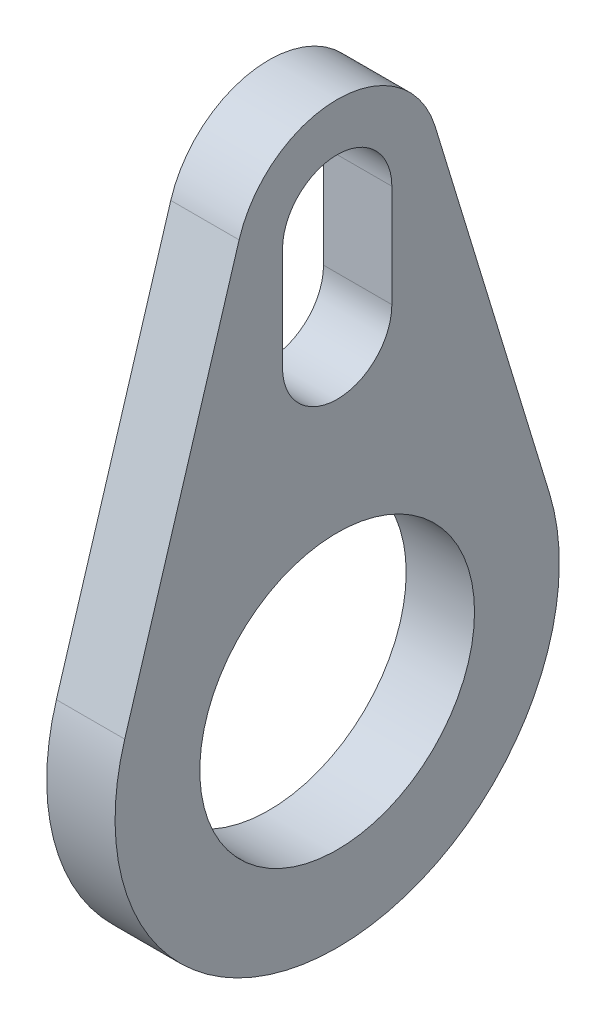
ISO-10303-21;
HEADER;
FILE_DESCRIPTION(('STEP AP214'),'2;1');
FILE_NAME('part.step','',(''),(''),'','','');
FILE_SCHEMA(('AUTOMOTIVE_DESIGN { 1 0 10303 214 1 1 1 1 }'));
ENDSEC;
DATA;
#1=APPLICATION_CONTEXT('core data for automotive mechanical design processes');
#2=APPLICATION_PROTOCOL_DEFINITION('international standard','automotive_design',2000,#1);
#3=PRODUCT_CONTEXT('',#1,'mechanical');
#4=PRODUCT('Part','Part','',(#3));
#5=PRODUCT_RELATED_PRODUCT_CATEGORY('part','',(#4));
#6=PRODUCT_DEFINITION_FORMATION('','',#4);
#7=PRODUCT_DEFINITION_CONTEXT('part definition',#1,'design');
#8=PRODUCT_DEFINITION('design','',#6,#7);
#9=PRODUCT_DEFINITION_SHAPE('','',#8);
#10=(LENGTH_UNIT() NAMED_UNIT(*) SI_UNIT(.MILLI.,.METRE.));
#11=(NAMED_UNIT(*) PLANE_ANGLE_UNIT() SI_UNIT($,.RADIAN.));
#12=(NAMED_UNIT(*) SI_UNIT($,.STERADIAN.) SOLID_ANGLE_UNIT());
#13=UNCERTAINTY_MEASURE_WITH_UNIT(LENGTH_MEASURE(1.E-05),#10,'distance_accuracy_value','');
#14=(GEOMETRIC_REPRESENTATION_CONTEXT(3) GLOBAL_UNCERTAINTY_ASSIGNED_CONTEXT((#13)) GLOBAL_UNIT_ASSIGNED_CONTEXT((#10,
#11,#12)) REPRESENTATION_CONTEXT('',''));
#15=CARTESIAN_POINT('',(0.,0.,0.));
#16=DIRECTION('',(0.,0.,1.));
#17=DIRECTION('',(1.,0.,0.));
#18=AXIS2_PLACEMENT_3D('',#15,#16,#17);
#19=CARTESIAN_POINT('',(85.,4.73958333333333,15.5434503835663));
#20=DIRECTION('',(0.,0.291666666666667,0.956520023604083));
#21=DIRECTION('',(0.,-0.956520023604083,0.291666666666667));
#22=AXIS2_PLACEMENT_3D('',#19,#20,#21);
#23=PLANE('',#22);
#24=DIRECTION('',(0.,-0.956520023604083,0.291666666666667));
#25=VECTOR('',#24,1.);
#26=CARTESIAN_POINT('',(90.,4.73958333333333,15.5434503835663));
#27=LINE('',#26,#25);
#28=CARTESIAN_POINT('',(90.,32.1875,7.17390017703062));
#29=VERTEX_POINT('',#28);
#30=CARTESIAN_POINT('',(90.,4.73958333333333,15.5434503835663));
#31=VERTEX_POINT('',#30);
#32=EDGE_CURVE('E147',#29,#31,#27,.T.);
#33=ORIENTED_EDGE('',*,*,#32,.F.);
#34=DIRECTION('',(1.,0.,0.));
#35=VECTOR('',#34,1.);
#36=CARTESIAN_POINT('',(85.,32.1875,7.17390017703062));
#37=LINE('',#36,#35);
#38=CARTESIAN_POINT('',(85.,32.1875,7.17390017703062));
#39=VERTEX_POINT('',#38);
#40=EDGE_CURVE('E11',#39,#29,#37,.T.);
#41=ORIENTED_EDGE('',*,*,#40,.F.);
#42=DIRECTION('',(0.,-0.956520023604083,0.291666666666667));
#43=VECTOR('',#42,1.);
#44=CARTESIAN_POINT('',(85.,4.73958333333333,15.5434503835663));
#45=LINE('',#44,#43);
#46=CARTESIAN_POINT('',(85.,4.73958333333333,15.5434503835663));
#47=VERTEX_POINT('',#46);
#48=EDGE_CURVE('E127',#39,#47,#45,.T.);
#49=ORIENTED_EDGE('',*,*,#48,.T.);
#50=DIRECTION('',(1.,0.,0.));
#51=VECTOR('',#50,1.);
#52=CARTESIAN_POINT('',(85.,4.73958333333333,15.5434503835663));
#53=LINE('',#52,#51);
#54=EDGE_CURVE('E124',#47,#31,#53,.T.);
#55=ORIENTED_EDGE('',*,*,#54,.T.);
#56=EDGE_LOOP('',(#33,#41,#49,#55));
#57=FACE_BOUND('',#56,.T.);
#58=ADVANCED_FACE('F36',(#57),#23,.T.);
#59=CARTESIAN_POINT('',(85.,30.,0.));
#60=DIRECTION('',(1.,0.,0.));
#61=DIRECTION('',(0.,0.,-1.));
#62=AXIS2_PLACEMENT_3D('',#59,#60,#61);
#63=CYLINDRICAL_SURFACE('',#62,7.5);
#64=CARTESIAN_POINT('',(90.,30.,0.));
#65=DIRECTION('',(1.,0.,0.));
#66=DIRECTION('',(0.,0.,-1.));
#67=AXIS2_PLACEMENT_3D('',#64,#65,#66);
#68=CIRCLE('',#67,7.5);
#69=CARTESIAN_POINT('',(90.,32.1875,-7.17390017703062));
#70=VERTEX_POINT('',#69);
#71=EDGE_CURVE('E153',#29,#70,#68,.F.);
#72=ORIENTED_EDGE('',*,*,#71,.T.);
#73=DIRECTION('',(1.,0.,0.));
#74=VECTOR('',#73,1.);
#75=CARTESIAN_POINT('',(85.,32.1875,-7.17390017703062));
#76=LINE('',#75,#74);
#77=CARTESIAN_POINT('',(85.,32.1875,-7.17390017703062));
#78=VERTEX_POINT('',#77);
#79=EDGE_CURVE('E46',#78,#70,#76,.T.);
#80=ORIENTED_EDGE('',*,*,#79,.F.);
#81=CARTESIAN_POINT('',(85.,30.,0.));
#82=DIRECTION('',(1.,0.,0.));
#83=DIRECTION('',(0.,0.,-1.));
#84=AXIS2_PLACEMENT_3D('',#81,#82,#83);
#85=CIRCLE('',#84,7.5);
#86=EDGE_CURVE('E116',#39,#78,#85,.F.);
#87=ORIENTED_EDGE('',*,*,#86,.F.);
#88=ORIENTED_EDGE('',*,*,#40,.T.);
#89=EDGE_LOOP('',(#72,#80,#87,#88));
#90=FACE_BOUND('',#89,.T.);
#91=ADVANCED_FACE('F204',(#90),#63,.T.);
#92=CARTESIAN_POINT('',(85.,4.73958333333333,-15.5434503835663));
#93=DIRECTION('',(0.,-0.291666666666667,0.956520023604083));
#94=DIRECTION('',(0.,-0.956520023604083,-0.291666666666667));
#95=AXIS2_PLACEMENT_3D('',#92,#93,#94);
#96=PLANE('',#95);
#97=DIRECTION('',(0.,-0.956520023604083,-0.291666666666667));
#98=VECTOR('',#97,1.);
#99=CARTESIAN_POINT('',(90.,4.73958333333333,-15.5434503835663));
#100=LINE('',#99,#98);
#101=CARTESIAN_POINT('',(90.,4.73958333333333,-15.5434503835663));
#102=VERTEX_POINT('',#101);
#103=EDGE_CURVE('E83',#70,#102,#100,.T.);
#104=ORIENTED_EDGE('',*,*,#103,.T.);
#105=DIRECTION('',(1.,0.,0.));
#106=VECTOR('',#105,1.);
#107=CARTESIAN_POINT('',(85.,4.73958333333333,-15.5434503835663));
#108=LINE('',#107,#106);
#109=CARTESIAN_POINT('',(85.,4.73958333333333,-15.5434503835663));
#110=VERTEX_POINT('',#109);
#111=EDGE_CURVE('E120',#110,#102,#108,.T.);
#112=ORIENTED_EDGE('',*,*,#111,.F.);
#113=DIRECTION('',(0.,-0.956520023604083,-0.291666666666667));
#114=VECTOR('',#113,1.);
#115=CARTESIAN_POINT('',(85.,4.73958333333333,-15.5434503835663));
#116=LINE('',#115,#114);
#117=EDGE_CURVE('E110',#78,#110,#116,.T.);
#118=ORIENTED_EDGE('',*,*,#117,.F.);
#119=ORIENTED_EDGE('',*,*,#79,.T.);
#120=EDGE_LOOP('',(#104,#112,#118,#119));
#121=FACE_BOUND('',#120,.T.);
#122=ADVANCED_FACE('F121',(#121),#96,.F.);
#123=CARTESIAN_POINT('',(85.,22.5,0.));
#124=DIRECTION('',(1.,0.,0.));
#125=DIRECTION('',(0.,0.,-1.));
#126=AXIS2_PLACEMENT_3D('',#123,#124,#125);
#127=CYLINDRICAL_SURFACE('',#126,4.);
#128=CARTESIAN_POINT('',(90.,22.5,0.));
#129=DIRECTION('',(1.,0.,0.));
#130=DIRECTION('',(0.,0.,-1.));
#131=AXIS2_PLACEMENT_3D('',#128,#129,#130);
#132=CIRCLE('',#131,4.);
#133=CARTESIAN_POINT('',(90.,22.5,4.));
#134=VERTEX_POINT('',#133);
#135=CARTESIAN_POINT('',(90.,22.5,-4.));
#136=VERTEX_POINT('',#135);
#137=EDGE_CURVE('E137',#134,#136,#132,.T.);
#138=ORIENTED_EDGE('',*,*,#137,.T.);
#139=DIRECTION('',(1.,0.,0.));
#140=VECTOR('',#139,1.);
#141=CARTESIAN_POINT('',(85.,22.5,-4.));
#142=LINE('',#141,#140);
#143=CARTESIAN_POINT('',(85.,22.5,-4.));
#144=VERTEX_POINT('',#143);
#145=EDGE_CURVE('E158',#144,#136,#142,.T.);
#146=ORIENTED_EDGE('',*,*,#145,.F.);
#147=CARTESIAN_POINT('',(85.,22.5,0.));
#148=DIRECTION('',(1.,0.,0.));
#149=DIRECTION('',(0.,0.,-1.));
#150=AXIS2_PLACEMENT_3D('',#147,#148,#149);
#151=CIRCLE('',#150,4.);
#152=CARTESIAN_POINT('',(85.,22.5,4.));
#153=VERTEX_POINT('',#152);
#154=EDGE_CURVE('E172',#153,#144,#151,.T.);
#155=ORIENTED_EDGE('',*,*,#154,.F.);
#156=DIRECTION('',(1.,0.,0.));
#157=VECTOR('',#156,1.);
#158=CARTESIAN_POINT('',(85.,22.5,4.));
#159=LINE('',#158,#157);
#160=EDGE_CURVE('E40',#153,#134,#159,.T.);
#161=ORIENTED_EDGE('',*,*,#160,.T.);
#162=EDGE_LOOP('',(#138,#146,#155,#161));
#163=FACE_BOUND('',#162,.T.);
#164=ADVANCED_FACE('F170',(#163),#127,.F.);
#165=CARTESIAN_POINT('',(85.,0.,-4.));
#166=DIRECTION('',(0.,0.,1.));
#167=DIRECTION('',(0.,-1.,0.));
#168=AXIS2_PLACEMENT_3D('',#165,#166,#167);
#169=PLANE('',#168);
#170=DIRECTION('',(0.,-1.,0.));
#171=VECTOR('',#170,1.);
#172=CARTESIAN_POINT('',(90.,0.,-4.));
#173=LINE('',#172,#171);
#174=CARTESIAN_POINT('',(90.,30.,-4.));
#175=VERTEX_POINT('',#174);
#176=EDGE_CURVE('E144',#175,#136,#173,.T.);
#177=ORIENTED_EDGE('',*,*,#176,.F.);
#178=DIRECTION('',(1.,0.,0.));
#179=VECTOR('',#178,1.);
#180=CARTESIAN_POINT('',(85.,30.,-4.));
#181=LINE('',#180,#179);
#182=CARTESIAN_POINT('',(85.,30.,-4.));
#183=VERTEX_POINT('',#182);
#184=EDGE_CURVE('E160',#183,#175,#181,.T.);
#185=ORIENTED_EDGE('',*,*,#184,.F.);
#186=DIRECTION('',(0.,-1.,0.));
#187=VECTOR('',#186,1.);
#188=CARTESIAN_POINT('',(85.,0.,-4.));
#189=LINE('',#188,#187);
#190=EDGE_CURVE('E129',#183,#144,#189,.T.);
#191=ORIENTED_EDGE('',*,*,#190,.T.);
#192=ORIENTED_EDGE('',*,*,#145,.T.);
#193=EDGE_LOOP('',(#177,#185,#191,#192));
#194=FACE_BOUND('',#193,.T.);
#195=ADVANCED_FACE('F178',(#194),#169,.T.);
#196=CARTESIAN_POINT('',(85.,30.,0.));
#197=DIRECTION('',(1.,0.,0.));
#198=DIRECTION('',(0.,0.,-1.));
#199=AXIS2_PLACEMENT_3D('',#196,#197,#198);
#200=CYLINDRICAL_SURFACE('',#199,4.);
#201=CARTESIAN_POINT('',(90.,30.,0.));
#202=DIRECTION('',(1.,0.,0.));
#203=DIRECTION('',(0.,0.,-1.));
#204=AXIS2_PLACEMENT_3D('',#201,#202,#203);
#205=CIRCLE('',#204,4.);
#206=CARTESIAN_POINT('',(90.,30.,4.));
#207=VERTEX_POINT('',#206);
#208=EDGE_CURVE('E142',#175,#207,#205,.T.);
#209=ORIENTED_EDGE('',*,*,#208,.T.);
#210=DIRECTION('',(1.,0.,0.));
#211=VECTOR('',#210,1.);
#212=CARTESIAN_POINT('',(85.,30.,4.));
#213=LINE('',#212,#211);
#214=CARTESIAN_POINT('',(85.,30.,4.));
#215=VERTEX_POINT('',#214);
#216=EDGE_CURVE('E161',#215,#207,#213,.T.);
#217=ORIENTED_EDGE('',*,*,#216,.F.);
#218=CARTESIAN_POINT('',(85.,30.,0.));
#219=DIRECTION('',(1.,0.,0.));
#220=DIRECTION('',(0.,0.,-1.));
#221=AXIS2_PLACEMENT_3D('',#218,#219,#220);
#222=CIRCLE('',#221,4.);
#223=EDGE_CURVE('E182',#183,#215,#222,.T.);
#224=ORIENTED_EDGE('',*,*,#223,.F.);
#225=ORIENTED_EDGE('',*,*,#184,.T.);
#226=EDGE_LOOP('',(#209,#217,#224,#225));
#227=FACE_BOUND('',#226,.T.);
#228=ADVANCED_FACE('F214',(#227),#200,.F.);
#229=CARTESIAN_POINT('',(85.,0.,4.));
#230=DIRECTION('',(0.,0.,1.));
#231=DIRECTION('',(0.,-1.,0.));
#232=AXIS2_PLACEMENT_3D('',#229,#230,#231);
#233=PLANE('',#232);
#234=DIRECTION('',(0.,-1.,0.));
#235=VECTOR('',#234,1.);
#236=CARTESIAN_POINT('',(90.,0.,4.));
#237=LINE('',#236,#235);
#238=EDGE_CURVE('E140',#207,#134,#237,.T.);
#239=ORIENTED_EDGE('',*,*,#238,.T.);
#240=ORIENTED_EDGE('',*,*,#160,.F.);
#241=DIRECTION('',(0.,-1.,0.));
#242=VECTOR('',#241,1.);
#243=CARTESIAN_POINT('',(85.,0.,4.));
#244=LINE('',#243,#242);
#245=EDGE_CURVE('E95',#215,#153,#244,.T.);
#246=ORIENTED_EDGE('',*,*,#245,.F.);
#247=ORIENTED_EDGE('',*,*,#216,.T.);
#248=EDGE_LOOP('',(#239,#240,#246,#247));
#249=FACE_BOUND('',#248,.T.);
#250=ADVANCED_FACE('F193',(#249),#233,.F.);
#251=CARTESIAN_POINT('',(85.,0.,0.));
#252=DIRECTION('',(1.,0.,0.));
#253=DIRECTION('',(0.,0.,-1.));
#254=AXIS2_PLACEMENT_3D('',#251,#252,#253);
#255=CYLINDRICAL_SURFACE('',#254,10.05);
#256=CARTESIAN_POINT('',(85.,0.,0.));
#257=DIRECTION('',(1.,0.,0.));
#258=DIRECTION('',(0.,0.,-1.));
#259=AXIS2_PLACEMENT_3D('',#256,#257,#258);
#260=CIRCLE('',#259,10.05);
#261=CARTESIAN_POINT('',(85.,0.,-10.05));
#262=VERTEX_POINT('',#261);
#263=EDGE_CURVE('E154',#262,#262,#260,.T.);
#264=ORIENTED_EDGE('',*,*,#263,.F.);
#265=EDGE_LOOP('',(#264));
#266=FACE_BOUND('',#265,.T.);
#267=CARTESIAN_POINT('',(90.,0.,0.));
#268=DIRECTION('',(1.,0.,0.));
#269=DIRECTION('',(0.,0.,-1.));
#270=AXIS2_PLACEMENT_3D('',#267,#268,#269);
#271=CIRCLE('',#270,10.05);
#272=CARTESIAN_POINT('',(90.,0.,-10.05));
#273=VERTEX_POINT('',#272);
#274=EDGE_CURVE('E134',#273,#273,#271,.T.);
#275=ORIENTED_EDGE('',*,*,#274,.T.);
#276=EDGE_LOOP('',(#275));
#277=FACE_BOUND('',#276,.T.);
#278=ADVANCED_FACE('F38',(#266,#277),#255,.F.);
#279=CARTESIAN_POINT('',(85.,0.,0.));
#280=DIRECTION('',(1.,0.,0.));
#281=DIRECTION('',(0.,0.,-1.));
#282=AXIS2_PLACEMENT_3D('',#279,#280,#281);
#283=CYLINDRICAL_SURFACE('',#282,16.25);
#284=CARTESIAN_POINT('',(90.,0.,0.));
#285=DIRECTION('',(1.,0.,0.));
#286=DIRECTION('',(0.,0.,-1.));
#287=AXIS2_PLACEMENT_3D('',#284,#285,#286);
#288=CIRCLE('',#287,16.25);
#289=EDGE_CURVE('E150',#31,#102,#288,.T.);
#290=ORIENTED_EDGE('',*,*,#289,.F.);
#291=ORIENTED_EDGE('',*,*,#54,.F.);
#292=CARTESIAN_POINT('',(85.,0.,0.));
#293=DIRECTION('',(1.,0.,0.));
#294=DIRECTION('',(0.,0.,-1.));
#295=AXIS2_PLACEMENT_3D('',#292,#293,#294);
#296=CIRCLE('',#295,16.25);
#297=EDGE_CURVE('E115',#47,#110,#296,.T.);
#298=ORIENTED_EDGE('',*,*,#297,.T.);
#299=ORIENTED_EDGE('',*,*,#111,.T.);
#300=EDGE_LOOP('',(#290,#291,#298,#299));
#301=FACE_BOUND('',#300,.T.);
#302=ADVANCED_FACE('F126',(#301),#283,.T.);
#303=CARTESIAN_POINT('',(85.,0.,0.));
#304=DIRECTION('',(1.,0.,0.));
#305=DIRECTION('',(0.,0.,-1.));
#306=AXIS2_PLACEMENT_3D('',#303,#304,#305);
#307=PLANE('',#306);
#308=ORIENTED_EDGE('',*,*,#263,.T.);
#309=EDGE_LOOP('',(#308));
#310=FACE_BOUND('',#309,.T.);
#311=ORIENTED_EDGE('',*,*,#154,.T.);
#312=ORIENTED_EDGE('',*,*,#190,.F.);
#313=ORIENTED_EDGE('',*,*,#223,.T.);
#314=ORIENTED_EDGE('',*,*,#245,.T.);
#315=EDGE_LOOP('',(#311,#312,#313,#314));
#316=FACE_BOUND('',#315,.T.);
#317=ORIENTED_EDGE('',*,*,#48,.F.);
#318=ORIENTED_EDGE('',*,*,#86,.T.);
#319=ORIENTED_EDGE('',*,*,#117,.T.);
#320=ORIENTED_EDGE('',*,*,#297,.F.);
#321=EDGE_LOOP('',(#317,#318,#319,#320));
#322=FACE_BOUND('',#321,.T.);
#323=ADVANCED_FACE('F113',(#310,#316,#322),#307,.F.);
#324=CARTESIAN_POINT('',(90.,0.,0.));
#325=DIRECTION('',(1.,0.,0.));
#326=DIRECTION('',(0.,0.,-1.));
#327=AXIS2_PLACEMENT_3D('',#324,#325,#326);
#328=PLANE('',#327);
#329=ORIENTED_EDGE('',*,*,#274,.F.);
#330=EDGE_LOOP('',(#329));
#331=FACE_BOUND('',#330,.T.);
#332=ORIENTED_EDGE('',*,*,#137,.F.);
#333=ORIENTED_EDGE('',*,*,#238,.F.);
#334=ORIENTED_EDGE('',*,*,#208,.F.);
#335=ORIENTED_EDGE('',*,*,#176,.T.);
#336=EDGE_LOOP('',(#332,#333,#334,#335));
#337=FACE_BOUND('',#336,.T.);
#338=ORIENTED_EDGE('',*,*,#32,.T.);
#339=ORIENTED_EDGE('',*,*,#289,.T.);
#340=ORIENTED_EDGE('',*,*,#103,.F.);
#341=ORIENTED_EDGE('',*,*,#71,.F.);
#342=EDGE_LOOP('',(#338,#339,#340,#341));
#343=FACE_BOUND('',#342,.T.);
#344=ADVANCED_FACE('F174',(#331,#337,#343),#328,.T.);
#345=CLOSED_SHELL('',(#58,#91,#122,#164,#195,#228,#250,#278,#302,#323,#344));
#346=MANIFOLD_SOLID_BREP('B2',#345);
#347=ADVANCED_BREP_SHAPE_REPRESENTATION('',(#18,#346),#14);
#348=SHAPE_DEFINITION_REPRESENTATION(#9,#347);
ENDSEC;
END-ISO-10303-21;
